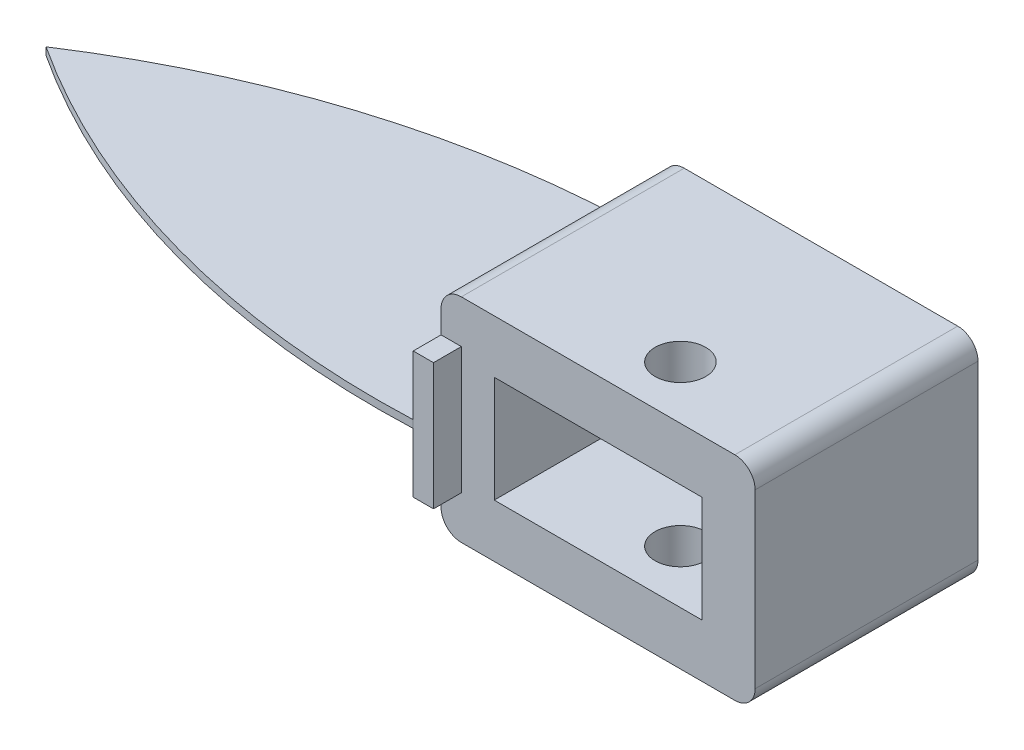
ISO-10303-21;
HEADER;
FILE_DESCRIPTION(('STEP AP214'),'2;1');
FILE_NAME('part.step','',(''),(''),'','','');
FILE_SCHEMA(('AUTOMOTIVE_DESIGN { 1 0 10303 214 1 1 1 1 }'));
ENDSEC;
DATA;
#1=APPLICATION_CONTEXT('core data for automotive mechanical design processes');
#2=APPLICATION_PROTOCOL_DEFINITION('international standard','automotive_design',2000,#1);
#3=PRODUCT_CONTEXT('',#1,'mechanical');
#4=PRODUCT('Part','Part','',(#3));
#5=PRODUCT_RELATED_PRODUCT_CATEGORY('part','',(#4));
#6=PRODUCT_DEFINITION_FORMATION('','',#4);
#7=PRODUCT_DEFINITION_CONTEXT('part definition',#1,'design');
#8=PRODUCT_DEFINITION('design','',#6,#7);
#9=PRODUCT_DEFINITION_SHAPE('','',#8);
#10=(LENGTH_UNIT() NAMED_UNIT(*) SI_UNIT(.MILLI.,.METRE.));
#11=(NAMED_UNIT(*) PLANE_ANGLE_UNIT() SI_UNIT($,.RADIAN.));
#12=(NAMED_UNIT(*) SI_UNIT($,.STERADIAN.) SOLID_ANGLE_UNIT());
#13=UNCERTAINTY_MEASURE_WITH_UNIT(LENGTH_MEASURE(1.E-05),#10,'distance_accuracy_value','');
#14=(GEOMETRIC_REPRESENTATION_CONTEXT(3) GLOBAL_UNCERTAINTY_ASSIGNED_CONTEXT((#13)) GLOBAL_UNIT_ASSIGNED_CONTEXT((#10,
#11,#12)) REPRESENTATION_CONTEXT('',''));
#15=CARTESIAN_POINT('',(0.,0.,0.));
#16=DIRECTION('',(0.,0.,1.));
#17=DIRECTION('',(1.,0.,0.));
#18=AXIS2_PLACEMENT_3D('',#15,#16,#17);
#19=CARTESIAN_POINT('',(-29.0958378036936,16.8639271046167,43.));
#20=DIRECTION('',(1.,0.,0.));
#21=DIRECTION('',(0.,1.,0.));
#22=AXIS2_PLACEMENT_3D('',#19,#20,#21);
#23=PLANE('',#22);
#24=DIRECTION('',(0.,0.,1.));
#25=VECTOR('',#24,1.);
#26=CARTESIAN_POINT('',(-29.0958378036936,-4.88607289538325,0.));
#27=LINE('',#26,#25);
#28=CARTESIAN_POINT('',(-29.0958378036936,-4.88607289538325,-6.50000000000001));
#29=VERTEX_POINT('',#28);
#30=CARTESIAN_POINT('',(-29.0958378036936,-4.88607289538325,48.5));
#31=VERTEX_POINT('',#30);
#32=EDGE_CURVE('E206',#29,#31,#27,.T.);
#33=ORIENTED_EDGE('',*,*,#32,.F.);
#34=DIRECTION('',(0.,-1.,0.));
#35=VECTOR('',#34,1.);
#36=CARTESIAN_POINT('',(-29.0958378036936,8.36392710461676,-6.50000000000001));
#37=LINE('',#36,#35);
#38=CARTESIAN_POINT('',(-29.0958378036936,-16.6360728953832,-6.50000000000001));
#39=VERTEX_POINT('',#38);
#40=EDGE_CURVE('E201',#29,#39,#37,.T.);
#41=ORIENTED_EDGE('',*,*,#40,.T.);
#42=DIRECTION('',(0.,0.,1.));
#43=VECTOR('',#42,1.);
#44=CARTESIAN_POINT('',(-29.0958378036936,-16.6360728953832,-6.50000000000001));
#45=LINE('',#44,#43);
#46=CARTESIAN_POINT('',(-29.0958378036936,-16.6360728953832,-1.));
#47=VERTEX_POINT('',#46);
#48=EDGE_CURVE('E235',#39,#47,#45,.T.);
#49=ORIENTED_EDGE('',*,*,#48,.T.);
#50=DIRECTION('',(0.,1.,0.));
#51=VECTOR('',#50,1.);
#52=CARTESIAN_POINT('',(-29.0958378036936,0.,-1.));
#53=LINE('',#52,#51);
#54=CARTESIAN_POINT('',(-29.0958378036936,-21.1360728953832,-1.));
#55=VERTEX_POINT('',#54);
#56=EDGE_CURVE('E252',#55,#47,#53,.T.);
#57=ORIENTED_EDGE('',*,*,#56,.F.);
#58=DIRECTION('',(0.,0.,1.));
#59=VECTOR('',#58,1.);
#60=CARTESIAN_POINT('',(-29.0958378036936,-21.1360728953832,43.));
#61=LINE('',#60,#59);
#62=CARTESIAN_POINT('',(-29.0958378036936,-21.1360728953832,43.));
#63=VERTEX_POINT('',#62);
#64=EDGE_CURVE('E353',#55,#63,#61,.T.);
#65=ORIENTED_EDGE('',*,*,#64,.T.);
#66=DIRECTION('',(0.,-1.,0.));
#67=VECTOR('',#66,1.);
#68=CARTESIAN_POINT('',(-29.0958378036936,16.8639271046167,43.));
#69=LINE('',#68,#67);
#70=CARTESIAN_POINT('',(-29.0958378036936,-16.6360728953832,43.));
#71=VERTEX_POINT('',#70);
#72=EDGE_CURVE('E330',#71,#63,#69,.T.);
#73=ORIENTED_EDGE('',*,*,#72,.F.);
#74=DIRECTION('',(0.,0.,-1.));
#75=VECTOR('',#74,1.);
#76=CARTESIAN_POINT('',(-29.0958378036936,-16.6360728953832,48.5));
#77=LINE('',#76,#75);
#78=CARTESIAN_POINT('',(-29.0958378036936,-16.6360728953832,48.5));
#79=VERTEX_POINT('',#78);
#80=EDGE_CURVE('E306',#79,#71,#77,.T.);
#81=ORIENTED_EDGE('',*,*,#80,.F.);
#82=DIRECTION('',(0.,-1.,0.));
#83=VECTOR('',#82,1.);
#84=CARTESIAN_POINT('',(-29.0958378036936,8.36392710461676,48.5));
#85=LINE('',#84,#83);
#86=EDGE_CURVE('E214',#31,#79,#85,.T.);
#87=ORIENTED_EDGE('',*,*,#86,.F.);
#88=EDGE_LOOP('',(#33,#41,#49,#57,#65,#73,#81,#87));
#89=FACE_BOUND('',#88,.T.);
#90=ADVANCED_FACE('F35',(#89),#23,.F.);
#91=CARTESIAN_POINT('',(-25.0958378036936,12.8639271046167,43.));
#92=DIRECTION('',(0.,0.,-1.));
#93=DIRECTION('',(-1.,0.,0.));
#94=AXIS2_PLACEMENT_3D('',#91,#92,#93);
#95=CYLINDRICAL_SURFACE('',#94,4.);
#96=DIRECTION('',(0.,0.,-1.));
#97=VECTOR('',#96,1.);
#98=CARTESIAN_POINT('',(-29.0958378036936,12.8639271046167,43.));
#99=LINE('',#98,#97);
#100=CARTESIAN_POINT('',(-29.0958378036936,12.8639271046167,43.));
#101=VERTEX_POINT('',#100);
#102=CARTESIAN_POINT('',(-29.0958378036936,12.8639271046167,-1.));
#103=VERTEX_POINT('',#102);
#104=EDGE_CURVE('E373',#101,#103,#99,.T.);
#105=ORIENTED_EDGE('',*,*,#104,.F.);
#106=CARTESIAN_POINT('',(-25.0958378036936,12.8639271046167,43.));
#107=DIRECTION('',(0.,0.,1.));
#108=DIRECTION('',(1.,0.,0.));
#109=AXIS2_PLACEMENT_3D('',#106,#107,#108);
#110=CIRCLE('',#109,4.);
#111=CARTESIAN_POINT('',(-25.0958378036936,16.8639271046167,43.));
#112=VERTEX_POINT('',#111);
#113=EDGE_CURVE('E379',#112,#101,#110,.T.);
#114=ORIENTED_EDGE('',*,*,#113,.F.);
#115=DIRECTION('',(0.,0.,-1.));
#116=VECTOR('',#115,1.);
#117=CARTESIAN_POINT('',(-25.0958378036936,16.8639271046167,43.));
#118=LINE('',#117,#116);
#119=CARTESIAN_POINT('',(-25.0958378036936,16.8639271046167,-1.));
#120=VERTEX_POINT('',#119);
#121=EDGE_CURVE('E376',#120,#112,#118,.F.);
#122=ORIENTED_EDGE('',*,*,#121,.F.);
#123=CARTESIAN_POINT('',(-25.0958378036936,12.8639271046167,-1.));
#124=DIRECTION('',(0.,0.,-1.));
#125=DIRECTION('',(-1.,0.,0.));
#126=AXIS2_PLACEMENT_3D('',#123,#124,#125);
#127=CIRCLE('',#126,4.);
#128=EDGE_CURVE('E381',#103,#120,#127,.T.);
#129=ORIENTED_EDGE('',*,*,#128,.F.);
#130=EDGE_LOOP('',(#105,#114,#122,#129));
#131=FACE_BOUND('',#130,.T.);
#132=ADVANCED_FACE('F37',(#131),#95,.T.);
#133=CARTESIAN_POINT('',(28.9041621963064,12.8639271046168,43.));
#134=DIRECTION('',(0.,0.,-1.));
#135=DIRECTION('',(-1.,0.,0.));
#136=AXIS2_PLACEMENT_3D('',#133,#134,#135);
#137=CYLINDRICAL_SURFACE('',#136,4.);
#138=DIRECTION('',(0.,0.,-1.));
#139=VECTOR('',#138,1.);
#140=CARTESIAN_POINT('',(28.9041621963064,16.8639271046168,43.));
#141=LINE('',#140,#139);
#142=CARTESIAN_POINT('',(28.9041621963064,16.8639271046168,43.));
#143=VERTEX_POINT('',#142);
#144=CARTESIAN_POINT('',(28.9041621963064,16.8639271046168,-1.));
#145=VERTEX_POINT('',#144);
#146=EDGE_CURVE('E363',#143,#145,#141,.T.);
#147=ORIENTED_EDGE('',*,*,#146,.F.);
#148=CARTESIAN_POINT('',(28.9041621963064,12.8639271046168,43.));
#149=DIRECTION('',(0.,0.,1.));
#150=DIRECTION('',(1.,0.,0.));
#151=AXIS2_PLACEMENT_3D('',#148,#149,#150);
#152=CIRCLE('',#151,4.);
#153=CARTESIAN_POINT('',(32.9041621963064,12.8639271046168,43.));
#154=VERTEX_POINT('',#153);
#155=EDGE_CURVE('E369',#154,#143,#152,.T.);
#156=ORIENTED_EDGE('',*,*,#155,.F.);
#157=DIRECTION('',(0.,0.,-1.));
#158=VECTOR('',#157,1.);
#159=CARTESIAN_POINT('',(32.9041621963064,12.8639271046168,43.));
#160=LINE('',#159,#158);
#161=CARTESIAN_POINT('',(32.9041621963064,12.8639271046168,-1.));
#162=VERTEX_POINT('',#161);
#163=EDGE_CURVE('E366',#162,#154,#160,.F.);
#164=ORIENTED_EDGE('',*,*,#163,.F.);
#165=CARTESIAN_POINT('',(28.9041621963064,12.8639271046168,-1.));
#166=DIRECTION('',(0.,0.,-1.));
#167=DIRECTION('',(-1.,0.,0.));
#168=AXIS2_PLACEMENT_3D('',#165,#166,#167);
#169=CIRCLE('',#168,4.);
#170=EDGE_CURVE('E371',#145,#162,#169,.T.);
#171=ORIENTED_EDGE('',*,*,#170,.F.);
#172=EDGE_LOOP('',(#147,#156,#164,#171));
#173=FACE_BOUND('',#172,.T.);
#174=ADVANCED_FACE('F439',(#173),#137,.T.);
#175=CARTESIAN_POINT('',(-25.0958378036936,-21.1360728953832,43.));
#176=DIRECTION('',(0.,0.,1.));
#177=DIRECTION('',(1.,0.,0.));
#178=AXIS2_PLACEMENT_3D('',#175,#176,#177);
#179=CYLINDRICAL_SURFACE('',#178,4.);
#180=ORIENTED_EDGE('',*,*,#64,.F.);
#181=CARTESIAN_POINT('',(-25.0958378036936,-21.1360728953832,-1.));
#182=DIRECTION('',(0.,0.,-1.));
#183=DIRECTION('',(-1.,0.,0.));
#184=AXIS2_PLACEMENT_3D('',#181,#182,#183);
#185=CIRCLE('',#184,4.);
#186=CARTESIAN_POINT('',(-25.0958378036936,-25.1360728953832,-1.));
#187=VERTEX_POINT('',#186);
#188=EDGE_CURVE('E359',#187,#55,#185,.T.);
#189=ORIENTED_EDGE('',*,*,#188,.F.);
#190=DIRECTION('',(0.,0.,1.));
#191=VECTOR('',#190,1.);
#192=CARTESIAN_POINT('',(-25.0958378036936,-25.1360728953832,43.));
#193=LINE('',#192,#191);
#194=CARTESIAN_POINT('',(-25.0958378036936,-25.1360728953832,43.));
#195=VERTEX_POINT('',#194);
#196=EDGE_CURVE('E356',#195,#187,#193,.F.);
#197=ORIENTED_EDGE('',*,*,#196,.F.);
#198=CARTESIAN_POINT('',(-25.0958378036936,-21.1360728953832,43.));
#199=DIRECTION('',(0.,0.,1.));
#200=DIRECTION('',(1.,0.,0.));
#201=AXIS2_PLACEMENT_3D('',#198,#199,#200);
#202=CIRCLE('',#201,4.);
#203=EDGE_CURVE('E361',#63,#195,#202,.T.);
#204=ORIENTED_EDGE('',*,*,#203,.F.);
#205=EDGE_LOOP('',(#180,#189,#197,#204));
#206=FACE_BOUND('',#205,.T.);
#207=ADVANCED_FACE('F399',(#206),#179,.T.);
#208=CARTESIAN_POINT('',(28.9041621963064,-21.1360728953832,43.));
#209=DIRECTION('',(0.,0.,1.));
#210=DIRECTION('',(1.,0.,0.));
#211=AXIS2_PLACEMENT_3D('',#208,#209,#210);
#212=CYLINDRICAL_SURFACE('',#211,4.);
#213=DIRECTION('',(0.,0.,1.));
#214=VECTOR('',#213,1.);
#215=CARTESIAN_POINT('',(28.9041621963064,-25.1360728953832,43.));
#216=LINE('',#215,#214);
#217=CARTESIAN_POINT('',(28.9041621963064,-25.1360728953832,-1.));
#218=VERTEX_POINT('',#217);
#219=CARTESIAN_POINT('',(28.9041621963064,-25.1360728953832,43.));
#220=VERTEX_POINT('',#219);
#221=EDGE_CURVE('E341',#218,#220,#216,.T.);
#222=ORIENTED_EDGE('',*,*,#221,.F.);
#223=CARTESIAN_POINT('',(28.9041621963064,-21.1360728953832,-1.));
#224=DIRECTION('',(0.,0.,-1.));
#225=DIRECTION('',(-1.,0.,0.));
#226=AXIS2_PLACEMENT_3D('',#223,#224,#225);
#227=CIRCLE('',#226,4.);
#228=CARTESIAN_POINT('',(32.9041621963064,-21.1360728953832,-1.));
#229=VERTEX_POINT('',#228);
#230=EDGE_CURVE('E349',#229,#218,#227,.T.);
#231=ORIENTED_EDGE('',*,*,#230,.F.);
#232=DIRECTION('',(0.,0.,1.));
#233=VECTOR('',#232,1.);
#234=CARTESIAN_POINT('',(32.9041621963064,-21.1360728953832,43.));
#235=LINE('',#234,#233);
#236=CARTESIAN_POINT('',(32.9041621963064,-21.1360728953832,43.));
#237=VERTEX_POINT('',#236);
#238=EDGE_CURVE('E346',#237,#229,#235,.F.);
#239=ORIENTED_EDGE('',*,*,#238,.F.);
#240=CARTESIAN_POINT('',(28.9041621963064,-21.1360728953832,43.));
#241=DIRECTION('',(0.,0.,1.));
#242=DIRECTION('',(1.,0.,0.));
#243=AXIS2_PLACEMENT_3D('',#240,#241,#242);
#244=CIRCLE('',#243,4.);
#245=EDGE_CURVE('E351',#220,#237,#244,.T.);
#246=ORIENTED_EDGE('',*,*,#245,.F.);
#247=EDGE_LOOP('',(#222,#231,#239,#246));
#248=FACE_BOUND('',#247,.T.);
#249=ADVANCED_FACE('F479',(#248),#212,.T.);
#250=CARTESIAN_POINT('',(-18.5958378036936,6.36392710461675,43.));
#251=DIRECTION('',(1.,0.,0.));
#252=DIRECTION('',(0.,1.,0.));
#253=AXIS2_PLACEMENT_3D('',#250,#251,#252);
#254=PLANE('',#253);
#255=DIRECTION('',(0.,0.,-1.));
#256=VECTOR('',#255,1.);
#257=CARTESIAN_POINT('',(-18.5958378036936,-14.6360728953832,43.));
#258=LINE('',#257,#256);
#259=CARTESIAN_POINT('',(-18.5958378036936,-14.6360728953832,43.));
#260=VERTEX_POINT('',#259);
#261=CARTESIAN_POINT('',(-18.5958378036936,-14.6360728953832,1.));
#262=VERTEX_POINT('',#261);
#263=EDGE_CURVE('E327',#260,#262,#258,.T.);
#264=ORIENTED_EDGE('',*,*,#263,.T.);
#265=DIRECTION('',(0.,-1.,0.));
#266=VECTOR('',#265,1.);
#267=CARTESIAN_POINT('',(-18.5958378036936,0.,1.));
#268=LINE('',#267,#266);
#269=CARTESIAN_POINT('',(-18.5958378036936,6.36392710461675,1.));
#270=VERTEX_POINT('',#269);
#271=EDGE_CURVE('E263',#270,#262,#268,.T.);
#272=ORIENTED_EDGE('',*,*,#271,.F.);
#273=DIRECTION('',(0.,0.,-1.));
#274=VECTOR('',#273,1.);
#275=CARTESIAN_POINT('',(-18.5958378036936,6.36392710461675,43.));
#276=LINE('',#275,#274);
#277=CARTESIAN_POINT('',(-18.5958378036936,6.36392710461675,43.));
#278=VERTEX_POINT('',#277);
#279=EDGE_CURVE('E318',#278,#270,#276,.T.);
#280=ORIENTED_EDGE('',*,*,#279,.F.);
#281=DIRECTION('',(0.,-1.,0.));
#282=VECTOR('',#281,1.);
#283=CARTESIAN_POINT('',(-18.5958378036936,6.36392710461675,43.));
#284=LINE('',#283,#282);
#285=EDGE_CURVE('E309',#278,#260,#284,.T.);
#286=ORIENTED_EDGE('',*,*,#285,.T.);
#287=EDGE_LOOP('',(#264,#272,#280,#286));
#288=FACE_BOUND('',#287,.T.);
#289=ADVANCED_FACE('F461',(#288),#254,.T.);
#290=CARTESIAN_POINT('',(-18.5958378036936,-14.6360728953832,43.));
#291=DIRECTION('',(0.,1.,0.));
#292=DIRECTION('',(-1.,0.,0.));
#293=AXIS2_PLACEMENT_3D('',#290,#291,#292);
#294=PLANE('',#293);
#295=CARTESIAN_POINT('',(7.65377673171643,-14.6360728953832,32.50038546459));
#296=DIRECTION('',(0.,1.,0.));
#297=DIRECTION('',(-1.,0.,0.));
#298=AXIS2_PLACEMENT_3D('',#295,#296,#297);
#299=CIRCLE('',#298,5.);
#300=CARTESIAN_POINT('',(2.65377673171643,-14.6360728953832,32.50038546459));
#301=VERTEX_POINT('',#300);
#302=EDGE_CURVE('E276',#301,#301,#299,.T.);
#303=ORIENTED_EDGE('',*,*,#302,.F.);
#304=EDGE_LOOP('',(#303));
#305=FACE_BOUND('',#304,.T.);
#306=DIRECTION('',(0.,0.,-1.));
#307=VECTOR('',#306,1.);
#308=CARTESIAN_POINT('',(22.4041621963064,-14.6360728953832,43.));
#309=LINE('',#308,#307);
#310=CARTESIAN_POINT('',(22.4041621963064,-14.6360728953832,43.));
#311=VERTEX_POINT('',#310);
#312=CARTESIAN_POINT('',(22.4041621963064,-14.6360728953832,1.));
#313=VERTEX_POINT('',#312);
#314=EDGE_CURVE('E324',#311,#313,#309,.T.);
#315=ORIENTED_EDGE('',*,*,#314,.T.);
#316=DIRECTION('',(1.,0.,0.));
#317=VECTOR('',#316,1.);
#318=CARTESIAN_POINT('',(0.,-14.6360728953832,1.));
#319=LINE('',#318,#317);
#320=EDGE_CURVE('E261',#262,#313,#319,.T.);
#321=ORIENTED_EDGE('',*,*,#320,.F.);
#322=ORIENTED_EDGE('',*,*,#263,.F.);
#323=DIRECTION('',(1.,0.,0.));
#324=VECTOR('',#323,1.);
#325=CARTESIAN_POINT('',(-18.5958378036936,-14.6360728953832,43.));
#326=LINE('',#325,#324);
#327=EDGE_CURVE('E311',#260,#311,#326,.T.);
#328=ORIENTED_EDGE('',*,*,#327,.T.);
#329=EDGE_LOOP('',(#315,#321,#322,#328));
#330=FACE_BOUND('',#329,.T.);
#331=ADVANCED_FACE('F505',(#305,#330),#294,.T.);
#332=CARTESIAN_POINT('',(22.4041621963064,6.36392710461676,43.));
#333=DIRECTION('',(-1.,0.,0.));
#334=DIRECTION('',(0.,-1.,0.));
#335=AXIS2_PLACEMENT_3D('',#332,#333,#334);
#336=PLANE('',#335);
#337=DIRECTION('',(0.,0.,-1.));
#338=VECTOR('',#337,1.);
#339=CARTESIAN_POINT('',(22.4041621963064,6.36392710461676,43.));
#340=LINE('',#339,#338);
#341=CARTESIAN_POINT('',(22.4041621963064,6.36392710461676,43.));
#342=VERTEX_POINT('',#341);
#343=CARTESIAN_POINT('',(22.4041621963064,6.36392710461676,1.));
#344=VERTEX_POINT('',#343);
#345=EDGE_CURVE('E321',#342,#344,#340,.T.);
#346=ORIENTED_EDGE('',*,*,#345,.T.);
#347=DIRECTION('',(0.,1.,0.));
#348=VECTOR('',#347,1.);
#349=CARTESIAN_POINT('',(22.4041621963064,0.,1.));
#350=LINE('',#349,#348);
#351=EDGE_CURVE('E267',#313,#344,#350,.T.);
#352=ORIENTED_EDGE('',*,*,#351,.F.);
#353=ORIENTED_EDGE('',*,*,#314,.F.);
#354=DIRECTION('',(0.,1.,0.));
#355=VECTOR('',#354,1.);
#356=CARTESIAN_POINT('',(22.4041621963064,6.36392710461676,43.));
#357=LINE('',#356,#355);
#358=EDGE_CURVE('E313',#311,#342,#357,.T.);
#359=ORIENTED_EDGE('',*,*,#358,.T.);
#360=EDGE_LOOP('',(#346,#352,#353,#359));
#361=FACE_BOUND('',#360,.T.);
#362=ADVANCED_FACE('F456',(#361),#336,.T.);
#363=CARTESIAN_POINT('',(-18.5958378036936,6.36392710461675,43.));
#364=DIRECTION('',(0.,-1.,0.));
#365=DIRECTION('',(1.,0.,0.));
#366=AXIS2_PLACEMENT_3D('',#363,#364,#365);
#367=PLANE('',#366);
#368=CARTESIAN_POINT('',(7.65377673171643,6.36392710461675,32.50038546459));
#369=DIRECTION('',(0.,-1.,0.));
#370=DIRECTION('',(1.,0.,0.));
#371=AXIS2_PLACEMENT_3D('',#368,#369,#370);
#372=CIRCLE('',#371,5.);
#373=CARTESIAN_POINT('',(12.6537767317164,6.36392710461676,32.50038546459));
#374=VERTEX_POINT('',#373);
#375=EDGE_CURVE('E273',#374,#374,#372,.T.);
#376=ORIENTED_EDGE('',*,*,#375,.F.);
#377=EDGE_LOOP('',(#376));
#378=FACE_BOUND('',#377,.T.);
#379=ORIENTED_EDGE('',*,*,#279,.T.);
#380=DIRECTION('',(-1.,0.,0.));
#381=VECTOR('',#380,1.);
#382=CARTESIAN_POINT('',(0.,6.36392710461676,1.));
#383=LINE('',#382,#381);
#384=EDGE_CURVE('E265',#344,#270,#383,.T.);
#385=ORIENTED_EDGE('',*,*,#384,.F.);
#386=ORIENTED_EDGE('',*,*,#345,.F.);
#387=DIRECTION('',(-1.,0.,0.));
#388=VECTOR('',#387,1.);
#389=CARTESIAN_POINT('',(-18.5958378036936,6.36392710461675,43.));
#390=LINE('',#389,#388);
#391=EDGE_CURVE('E316',#342,#278,#390,.T.);
#392=ORIENTED_EDGE('',*,*,#391,.T.);
#393=EDGE_LOOP('',(#379,#385,#386,#392));
#394=FACE_BOUND('',#393,.T.);
#395=ADVANCED_FACE('F451',(#378,#394),#367,.T.);
#396=CARTESIAN_POINT('',(0.,0.,43.));
#397=DIRECTION('',(0.,0.,1.));
#398=DIRECTION('',(1.,0.,0.));
#399=AXIS2_PLACEMENT_3D('',#396,#397,#398);
#400=PLANE('',#399);
#401=DIRECTION('',(-1.,0.,0.));
#402=VECTOR('',#401,1.);
#403=CARTESIAN_POINT('',(-29.0958378036936,16.8639271046167,43.));
#404=LINE('',#403,#402);
#405=EDGE_CURVE('E338',#143,#112,#404,.T.);
#406=ORIENTED_EDGE('',*,*,#405,.T.);
#407=ORIENTED_EDGE('',*,*,#113,.T.);
#408=CARTESIAN_POINT('',(-29.0958378036936,8.36392710461676,43.));
#409=VERTEX_POINT('',#408);
#410=EDGE_CURVE('E331',#101,#409,#69,.T.);
#411=ORIENTED_EDGE('',*,*,#410,.T.);
#412=DIRECTION('',(-1.,0.,0.));
#413=VECTOR('',#412,1.);
#414=CARTESIAN_POINT('',(-29.0958378036936,8.36392710461676,43.));
#415=LINE('',#414,#413);
#416=CARTESIAN_POINT('',(-25.0958378036936,8.36392710461676,43.));
#417=VERTEX_POINT('',#416);
#418=EDGE_CURVE('E295',#417,#409,#415,.T.);
#419=ORIENTED_EDGE('',*,*,#418,.F.);
#420=DIRECTION('',(0.,1.,0.));
#421=VECTOR('',#420,1.);
#422=CARTESIAN_POINT('',(-25.0958378036936,8.36392710461676,43.));
#423=LINE('',#422,#421);
#424=CARTESIAN_POINT('',(-25.0958378036936,-16.6360728953832,43.));
#425=VERTEX_POINT('',#424);
#426=EDGE_CURVE('E292',#425,#417,#423,.T.);
#427=ORIENTED_EDGE('',*,*,#426,.F.);
#428=DIRECTION('',(1.,0.,0.));
#429=VECTOR('',#428,1.);
#430=CARTESIAN_POINT('',(-29.0958378036936,-16.6360728953832,43.));
#431=LINE('',#430,#429);
#432=EDGE_CURVE('E279',#71,#425,#431,.T.);
#433=ORIENTED_EDGE('',*,*,#432,.F.);
#434=ORIENTED_EDGE('',*,*,#72,.T.);
#435=ORIENTED_EDGE('',*,*,#203,.T.);
#436=DIRECTION('',(1.,0.,0.));
#437=VECTOR('',#436,1.);
#438=CARTESIAN_POINT('',(-29.0958378036936,-25.1360728953832,43.));
#439=LINE('',#438,#437);
#440=EDGE_CURVE('E333',#195,#220,#439,.T.);
#441=ORIENTED_EDGE('',*,*,#440,.T.);
#442=ORIENTED_EDGE('',*,*,#245,.T.);
#443=DIRECTION('',(0.,1.,0.));
#444=VECTOR('',#443,1.);
#445=CARTESIAN_POINT('',(32.9041621963064,16.8639271046168,43.));
#446=LINE('',#445,#444);
#447=EDGE_CURVE('E335',#237,#154,#446,.T.);
#448=ORIENTED_EDGE('',*,*,#447,.T.);
#449=ORIENTED_EDGE('',*,*,#155,.T.);
#450=EDGE_LOOP('',(#406,#407,#411,#419,#427,#433,#434,#435,#441,#442,#448,#449));
#451=FACE_BOUND('',#450,.T.);
#452=ORIENTED_EDGE('',*,*,#327,.F.);
#453=ORIENTED_EDGE('',*,*,#285,.F.);
#454=ORIENTED_EDGE('',*,*,#391,.F.);
#455=ORIENTED_EDGE('',*,*,#358,.F.);
#456=EDGE_LOOP('',(#452,#453,#454,#455));
#457=FACE_BOUND('',#456,.T.);
#458=ADVANCED_FACE('F402',(#451,#457),#400,.T.);
#459=CARTESIAN_POINT('',(-29.0958378036936,8.36392710461676,-6.50000000000001));
#460=VERTEX_POINT('',#459);
#461=CARTESIAN_POINT('',(-29.0958378036936,-3.38607289538325,-6.50000000000001));
#462=VERTEX_POINT('',#461);
#463=EDGE_CURVE('E200',#460,#462,#37,.T.);
#464=ORIENTED_EDGE('',*,*,#463,.T.);
#465=DIRECTION('',(0.,0.,1.));
#466=VECTOR('',#465,1.);
#467=CARTESIAN_POINT('',(-29.0958378036936,-3.38607289538326,0.));
#468=LINE('',#467,#466);
#469=CARTESIAN_POINT('',(-29.0958378036936,-3.38607289538325,48.5));
#470=VERTEX_POINT('',#469);
#471=EDGE_CURVE('E419',#462,#470,#468,.T.);
#472=ORIENTED_EDGE('',*,*,#471,.T.);
#473=CARTESIAN_POINT('',(-29.0958378036936,8.36392710461676,48.5));
#474=VERTEX_POINT('',#473);
#475=EDGE_CURVE('E280',#474,#470,#85,.T.);
#476=ORIENTED_EDGE('',*,*,#475,.F.);
#477=DIRECTION('',(0.,0.,-1.));
#478=VECTOR('',#477,1.);
#479=CARTESIAN_POINT('',(-29.0958378036936,8.36392710461676,48.5));
#480=LINE('',#479,#478);
#481=EDGE_CURVE('E289',#474,#409,#480,.T.);
#482=ORIENTED_EDGE('',*,*,#481,.T.);
#483=ORIENTED_EDGE('',*,*,#410,.F.);
#484=ORIENTED_EDGE('',*,*,#104,.T.);
#485=CARTESIAN_POINT('',(-29.0958378036936,8.36392710461676,-1.));
#486=VERTEX_POINT('',#485);
#487=EDGE_CURVE('E251',#486,#103,#53,.T.);
#488=ORIENTED_EDGE('',*,*,#487,.F.);
#489=DIRECTION('',(0.,0.,1.));
#490=VECTOR('',#489,1.);
#491=CARTESIAN_POINT('',(-29.0958378036936,8.36392710461676,-6.50000000000001));
#492=LINE('',#491,#490);
#493=EDGE_CURVE('E236',#460,#486,#492,.T.);
#494=ORIENTED_EDGE('',*,*,#493,.F.);
#495=EDGE_LOOP('',(#464,#472,#476,#482,#483,#484,#488,#494));
#496=FACE_BOUND('',#495,.T.);
#497=ADVANCED_FACE('F435',(#496),#23,.F.);
#498=CARTESIAN_POINT('',(-29.0958378036936,-25.1360728953832,43.));
#499=DIRECTION('',(0.,1.,0.));
#500=DIRECTION('',(-1.,0.,0.));
#501=AXIS2_PLACEMENT_3D('',#498,#499,#500);
#502=PLANE('',#501);
#503=CARTESIAN_POINT('',(7.65377673171643,-25.1360728953833,32.50038546459));
#504=DIRECTION('',(0.,1.,0.));
#505=DIRECTION('',(-1.,0.,0.));
#506=AXIS2_PLACEMENT_3D('',#503,#504,#505);
#507=CIRCLE('',#506,5.);
#508=CARTESIAN_POINT('',(2.65377673171643,-25.1360728953833,32.50038546459));
#509=VERTEX_POINT('',#508);
#510=EDGE_CURVE('E270',#509,#509,#507,.T.);
#511=ORIENTED_EDGE('',*,*,#510,.T.);
#512=EDGE_LOOP('',(#511));
#513=FACE_BOUND('',#512,.T.);
#514=ORIENTED_EDGE('',*,*,#440,.F.);
#515=ORIENTED_EDGE('',*,*,#196,.T.);
#516=DIRECTION('',(-1.,0.,0.));
#517=VECTOR('',#516,1.);
#518=CARTESIAN_POINT('',(0.,-25.1360728953832,-1.));
#519=LINE('',#518,#517);
#520=EDGE_CURVE('E248',#218,#187,#519,.T.);
#521=ORIENTED_EDGE('',*,*,#520,.F.);
#522=ORIENTED_EDGE('',*,*,#221,.T.);
#523=EDGE_LOOP('',(#514,#515,#521,#522));
#524=FACE_BOUND('',#523,.T.);
#525=ADVANCED_FACE('F444',(#513,#524),#502,.F.);
#526=CARTESIAN_POINT('',(32.9041621963064,16.8639271046168,43.));
#527=DIRECTION('',(-1.,0.,0.));
#528=DIRECTION('',(0.,0.,1.));
#529=AXIS2_PLACEMENT_3D('',#526,#527,#528);
#530=PLANE('',#529);
#531=DIRECTION('',(0.,-1.,0.));
#532=VECTOR('',#531,1.);
#533=CARTESIAN_POINT('',(32.9041621963064,0.,-1.));
#534=LINE('',#533,#532);
#535=EDGE_CURVE('E256',#162,#229,#534,.T.);
#536=ORIENTED_EDGE('',*,*,#535,.F.);
#537=ORIENTED_EDGE('',*,*,#163,.T.);
#538=ORIENTED_EDGE('',*,*,#447,.F.);
#539=ORIENTED_EDGE('',*,*,#238,.T.);
#540=EDGE_LOOP('',(#536,#537,#538,#539));
#541=FACE_BOUND('',#540,.T.);
#542=ADVANCED_FACE('F449',(#541),#530,.F.);
#543=CARTESIAN_POINT('',(-29.0958378036936,16.8639271046167,43.));
#544=DIRECTION('',(0.,-1.,0.));
#545=DIRECTION('',(1.,0.,0.));
#546=AXIS2_PLACEMENT_3D('',#543,#544,#545);
#547=PLANE('',#546);
#548=CARTESIAN_POINT('',(7.65377673171642,16.8639271046167,32.50038546459));
#549=DIRECTION('',(0.,1.,0.));
#550=DIRECTION('',(-1.,0.,0.));
#551=AXIS2_PLACEMENT_3D('',#548,#549,#550);
#552=CIRCLE('',#551,5.);
#553=CARTESIAN_POINT('',(2.65377673171642,16.8639271046167,32.50038546459));
#554=VERTEX_POINT('',#553);
#555=EDGE_CURVE('E269',#554,#554,#552,.T.);
#556=ORIENTED_EDGE('',*,*,#555,.F.);
#557=EDGE_LOOP('',(#556));
#558=FACE_BOUND('',#557,.T.);
#559=DIRECTION('',(1.,0.,0.));
#560=VECTOR('',#559,1.);
#561=CARTESIAN_POINT('',(0.,16.8639271046167,-1.));
#562=LINE('',#561,#560);
#563=EDGE_CURVE('E254',#120,#145,#562,.T.);
#564=ORIENTED_EDGE('',*,*,#563,.F.);
#565=ORIENTED_EDGE('',*,*,#121,.T.);
#566=ORIENTED_EDGE('',*,*,#405,.F.);
#567=ORIENTED_EDGE('',*,*,#146,.T.);
#568=EDGE_LOOP('',(#564,#565,#566,#567));
#569=FACE_BOUND('',#568,.T.);
#570=ADVANCED_FACE('F463',(#558,#569),#547,.F.);
#571=CARTESIAN_POINT('',(-29.0958378036936,-16.6360728953832,48.5));
#572=DIRECTION('',(0.,1.,0.));
#573=DIRECTION('',(0.,0.,1.));
#574=AXIS2_PLACEMENT_3D('',#571,#572,#573);
#575=PLANE('',#574);
#576=ORIENTED_EDGE('',*,*,#432,.T.);
#577=DIRECTION('',(0.,0.,-1.));
#578=VECTOR('',#577,1.);
#579=CARTESIAN_POINT('',(-25.0958378036936,-16.6360728953832,48.5));
#580=LINE('',#579,#578);
#581=CARTESIAN_POINT('',(-25.0958378036936,-16.6360728953832,48.5));
#582=VERTEX_POINT('',#581);
#583=EDGE_CURVE('E303',#582,#425,#580,.T.);
#584=ORIENTED_EDGE('',*,*,#583,.F.);
#585=DIRECTION('',(1.,0.,0.));
#586=VECTOR('',#585,1.);
#587=CARTESIAN_POINT('',(-29.0958378036936,-16.6360728953832,48.5));
#588=LINE('',#587,#586);
#589=EDGE_CURVE('E283',#79,#582,#588,.T.);
#590=ORIENTED_EDGE('',*,*,#589,.F.);
#591=ORIENTED_EDGE('',*,*,#80,.T.);
#592=EDGE_LOOP('',(#576,#584,#590,#591));
#593=FACE_BOUND('',#592,.T.);
#594=ADVANCED_FACE('F407',(#593),#575,.F.);
#595=CARTESIAN_POINT('',(-25.0958378036936,8.36392710461676,48.5));
#596=DIRECTION('',(-1.,0.,0.));
#597=DIRECTION('',(0.,0.,1.));
#598=AXIS2_PLACEMENT_3D('',#595,#596,#597);
#599=PLANE('',#598);
#600=ORIENTED_EDGE('',*,*,#426,.T.);
#601=DIRECTION('',(0.,0.,-1.));
#602=VECTOR('',#601,1.);
#603=CARTESIAN_POINT('',(-25.0958378036936,8.36392710461676,48.5));
#604=LINE('',#603,#602);
#605=CARTESIAN_POINT('',(-25.0958378036936,8.36392710461676,48.5));
#606=VERTEX_POINT('',#605);
#607=EDGE_CURVE('E300',#606,#417,#604,.T.);
#608=ORIENTED_EDGE('',*,*,#607,.F.);
#609=DIRECTION('',(0.,1.,0.));
#610=VECTOR('',#609,1.);
#611=CARTESIAN_POINT('',(-25.0958378036936,8.36392710461676,48.5));
#612=LINE('',#611,#610);
#613=EDGE_CURVE('E285',#582,#606,#612,.T.);
#614=ORIENTED_EDGE('',*,*,#613,.F.);
#615=ORIENTED_EDGE('',*,*,#583,.T.);
#616=EDGE_LOOP('',(#600,#608,#614,#615));
#617=FACE_BOUND('',#616,.T.);
#618=ADVANCED_FACE('F493',(#617),#599,.F.);
#619=CARTESIAN_POINT('',(-29.0958378036936,8.36392710461676,48.5));
#620=DIRECTION('',(0.,-1.,0.));
#621=DIRECTION('',(0.,0.,-1.));
#622=AXIS2_PLACEMENT_3D('',#619,#620,#621);
#623=PLANE('',#622);
#624=ORIENTED_EDGE('',*,*,#418,.T.);
#625=ORIENTED_EDGE('',*,*,#481,.F.);
#626=DIRECTION('',(-1.,0.,0.));
#627=VECTOR('',#626,1.);
#628=CARTESIAN_POINT('',(-29.0958378036936,8.36392710461676,48.5));
#629=LINE('',#628,#627);
#630=EDGE_CURVE('E287',#606,#474,#629,.T.);
#631=ORIENTED_EDGE('',*,*,#630,.F.);
#632=ORIENTED_EDGE('',*,*,#607,.T.);
#633=EDGE_LOOP('',(#624,#625,#631,#632));
#634=FACE_BOUND('',#633,.T.);
#635=ADVANCED_FACE('F491',(#634),#623,.F.);
#636=CARTESIAN_POINT('',(0.,0.,48.5));
#637=DIRECTION('',(0.,0.,1.));
#638=DIRECTION('',(1.,0.,0.));
#639=AXIS2_PLACEMENT_3D('',#636,#637,#638);
#640=PLANE('',#639);
#641=ORIENTED_EDGE('',*,*,#475,.T.);
#642=EDGE_CURVE('E50',#470,#31,#85,.T.);
#643=ORIENTED_EDGE('',*,*,#642,.T.);
#644=ORIENTED_EDGE('',*,*,#86,.T.);
#645=ORIENTED_EDGE('',*,*,#589,.T.);
#646=ORIENTED_EDGE('',*,*,#613,.T.);
#647=ORIENTED_EDGE('',*,*,#630,.T.);
#648=EDGE_LOOP('',(#641,#643,#644,#645,#646,#647));
#649=FACE_BOUND('',#648,.T.);
#650=ADVANCED_FACE('F411',(#649),#640,.T.);
#651=CARTESIAN_POINT('',(7.65377673171643,-25.1360728953833,32.50038546459));
#652=DIRECTION('',(0.,1.,0.));
#653=DIRECTION('',(-1.,0.,0.));
#654=AXIS2_PLACEMENT_3D('',#651,#652,#653);
#655=CYLINDRICAL_SURFACE('',#654,5.);
#656=ORIENTED_EDGE('',*,*,#375,.T.);
#657=EDGE_LOOP('',(#656));
#658=FACE_BOUND('',#657,.T.);
#659=ORIENTED_EDGE('',*,*,#555,.T.);
#660=EDGE_LOOP('',(#659));
#661=FACE_BOUND('',#660,.T.);
#662=ADVANCED_FACE('F544',(#658,#661),#655,.F.);
#663=ORIENTED_EDGE('',*,*,#302,.T.);
#664=EDGE_LOOP('',(#663));
#665=FACE_BOUND('',#664,.T.);
#666=ORIENTED_EDGE('',*,*,#510,.F.);
#667=EDGE_LOOP('',(#666));
#668=FACE_BOUND('',#667,.T.);
#669=ADVANCED_FACE('F539',(#665,#668),#655,.F.);
#670=CARTESIAN_POINT('',(12.4041621963064,-4.13607289538324,1.));
#671=DIRECTION('',(0.,0.,-1.));
#672=DIRECTION('',(-1.,0.,0.));
#673=AXIS2_PLACEMENT_3D('',#670,#671,#672);
#674=CYLINDRICAL_SURFACE('',#673,7.);
#675=CARTESIAN_POINT('',(12.4041621963064,-4.13607289538324,1.));
#676=DIRECTION('',(0.,0.,-1.));
#677=DIRECTION('',(-1.,0.,0.));
#678=AXIS2_PLACEMENT_3D('',#675,#676,#677);
#679=CIRCLE('',#678,7.);
#680=CARTESIAN_POINT('',(5.40416219630642,-4.13607289538324,1.));
#681=VERTEX_POINT('',#680);
#682=EDGE_CURVE('E258',#681,#681,#679,.T.);
#683=ORIENTED_EDGE('',*,*,#682,.F.);
#684=EDGE_LOOP('',(#683));
#685=FACE_BOUND('',#684,.T.);
#686=CARTESIAN_POINT('',(12.4041621963064,-4.13607289538324,-1.));
#687=DIRECTION('',(0.,0.,-1.));
#688=DIRECTION('',(-1.,0.,0.));
#689=AXIS2_PLACEMENT_3D('',#686,#687,#688);
#690=CIRCLE('',#689,7.);
#691=CARTESIAN_POINT('',(5.40416219630642,-4.13607289538324,-1.));
#692=VERTEX_POINT('',#691);
#693=EDGE_CURVE('E239',#692,#692,#690,.T.);
#694=ORIENTED_EDGE('',*,*,#693,.T.);
#695=EDGE_LOOP('',(#694));
#696=FACE_BOUND('',#695,.T.);
#697=ADVANCED_FACE('F530',(#685,#696),#674,.F.);
#698=CARTESIAN_POINT('',(0.,0.,1.));
#699=DIRECTION('',(0.,0.,-1.));
#700=DIRECTION('',(-1.,0.,0.));
#701=AXIS2_PLACEMENT_3D('',#698,#699,#700);
#702=PLANE('',#701);
#703=ORIENTED_EDGE('',*,*,#682,.T.);
#704=EDGE_LOOP('',(#703));
#705=FACE_BOUND('',#704,.T.);
#706=ORIENTED_EDGE('',*,*,#320,.T.);
#707=ORIENTED_EDGE('',*,*,#351,.T.);
#708=ORIENTED_EDGE('',*,*,#384,.T.);
#709=ORIENTED_EDGE('',*,*,#271,.T.);
#710=EDGE_LOOP('',(#706,#707,#708,#709));
#711=FACE_BOUND('',#710,.T.);
#712=ADVANCED_FACE('F528',(#705,#711),#702,.F.);
#713=CARTESIAN_POINT('',(0.,0.,-1.));
#714=DIRECTION('',(0.,0.,-1.));
#715=DIRECTION('',(-1.,0.,0.));
#716=AXIS2_PLACEMENT_3D('',#713,#714,#715);
#717=PLANE('',#716);
#718=DIRECTION('',(1.,0.,0.));
#719=VECTOR('',#718,1.);
#720=CARTESIAN_POINT('',(0.,8.36392710461676,-1.));
#721=LINE('',#720,#719);
#722=CARTESIAN_POINT('',(-25.0958378036936,8.36392710461676,-1.));
#723=VERTEX_POINT('',#722);
#724=EDGE_CURVE('E11',#486,#723,#721,.T.);
#725=ORIENTED_EDGE('',*,*,#724,.F.);
#726=ORIENTED_EDGE('',*,*,#487,.T.);
#727=ORIENTED_EDGE('',*,*,#128,.T.);
#728=ORIENTED_EDGE('',*,*,#563,.T.);
#729=ORIENTED_EDGE('',*,*,#170,.T.);
#730=ORIENTED_EDGE('',*,*,#535,.T.);
#731=ORIENTED_EDGE('',*,*,#230,.T.);
#732=ORIENTED_EDGE('',*,*,#520,.T.);
#733=ORIENTED_EDGE('',*,*,#188,.T.);
#734=ORIENTED_EDGE('',*,*,#56,.T.);
#735=DIRECTION('',(-1.,0.,0.));
#736=VECTOR('',#735,1.);
#737=CARTESIAN_POINT('',(0.,-16.6360728953832,-1.));
#738=LINE('',#737,#736);
#739=CARTESIAN_POINT('',(-25.0958378036936,-16.6360728953832,-1.));
#740=VERTEX_POINT('',#739);
#741=EDGE_CURVE('E383',#740,#47,#738,.T.);
#742=ORIENTED_EDGE('',*,*,#741,.F.);
#743=DIRECTION('',(0.,-1.,0.));
#744=VECTOR('',#743,1.);
#745=CARTESIAN_POINT('',(-25.0958378036936,0.,-1.));
#746=LINE('',#745,#744);
#747=EDGE_CURVE('E43',#723,#740,#746,.T.);
#748=ORIENTED_EDGE('',*,*,#747,.F.);
#749=EDGE_LOOP('',(#725,#726,#727,#728,#729,#730,#731,#732,#733,#734,#742,#748));
#750=FACE_BOUND('',#749,.T.);
#751=ORIENTED_EDGE('',*,*,#693,.F.);
#752=EDGE_LOOP('',(#751));
#753=FACE_BOUND('',#752,.T.);
#754=ADVANCED_FACE('F394',(#750,#753),#717,.T.);
#755=CARTESIAN_POINT('',(-29.0958378036936,8.36392710461676,-6.50000000000001));
#756=DIRECTION('',(0.,1.,0.));
#757=DIRECTION('',(0.,0.,1.));
#758=AXIS2_PLACEMENT_3D('',#755,#756,#757);
#759=PLANE('',#758);
#760=ORIENTED_EDGE('',*,*,#493,.T.);
#761=ORIENTED_EDGE('',*,*,#724,.T.);
#762=DIRECTION('',(0.,0.,1.));
#763=VECTOR('',#762,1.);
#764=CARTESIAN_POINT('',(-25.0958378036936,8.36392710461676,-6.50000000000001));
#765=LINE('',#764,#763);
#766=CARTESIAN_POINT('',(-25.0958378036936,8.36392710461676,-6.50000000000001));
#767=VERTEX_POINT('',#766);
#768=EDGE_CURVE('E240',#767,#723,#765,.T.);
#769=ORIENTED_EDGE('',*,*,#768,.F.);
#770=DIRECTION('',(-1.,0.,0.));
#771=VECTOR('',#770,1.);
#772=CARTESIAN_POINT('',(-29.0958378036936,8.36392710461676,-6.50000000000001));
#773=LINE('',#772,#771);
#774=EDGE_CURVE('E230',#767,#460,#773,.T.);
#775=ORIENTED_EDGE('',*,*,#774,.T.);
#776=EDGE_LOOP('',(#760,#761,#769,#775));
#777=FACE_BOUND('',#776,.T.);
#778=ADVANCED_FACE('F537',(#777),#759,.T.);
#779=CARTESIAN_POINT('',(-25.0958378036936,8.36392710461676,-6.50000000000001));
#780=DIRECTION('',(1.,0.,0.));
#781=DIRECTION('',(0.,0.,-1.));
#782=AXIS2_PLACEMENT_3D('',#779,#780,#781);
#783=PLANE('',#782);
#784=ORIENTED_EDGE('',*,*,#768,.T.);
#785=ORIENTED_EDGE('',*,*,#747,.T.);
#786=DIRECTION('',(0.,0.,1.));
#787=VECTOR('',#786,1.);
#788=CARTESIAN_POINT('',(-25.0958378036936,-16.6360728953832,-6.50000000000001));
#789=LINE('',#788,#787);
#790=CARTESIAN_POINT('',(-25.0958378036936,-16.6360728953832,-6.50000000000001));
#791=VERTEX_POINT('',#790);
#792=EDGE_CURVE('E243',#791,#740,#789,.T.);
#793=ORIENTED_EDGE('',*,*,#792,.F.);
#794=DIRECTION('',(0.,1.,0.));
#795=VECTOR('',#794,1.);
#796=CARTESIAN_POINT('',(-25.0958378036936,8.36392710461676,-6.50000000000001));
#797=LINE('',#796,#795);
#798=EDGE_CURVE('E226',#791,#767,#797,.T.);
#799=ORIENTED_EDGE('',*,*,#798,.T.);
#800=EDGE_LOOP('',(#784,#785,#793,#799));
#801=FACE_BOUND('',#800,.T.);
#802=ADVANCED_FACE('F387',(#801),#783,.T.);
#803=CARTESIAN_POINT('',(-29.0958378036936,-16.6360728953832,-6.50000000000001));
#804=DIRECTION('',(0.,-1.,0.));
#805=DIRECTION('',(0.,0.,-1.));
#806=AXIS2_PLACEMENT_3D('',#803,#804,#805);
#807=PLANE('',#806);
#808=ORIENTED_EDGE('',*,*,#792,.T.);
#809=ORIENTED_EDGE('',*,*,#741,.T.);
#810=ORIENTED_EDGE('',*,*,#48,.F.);
#811=DIRECTION('',(1.,0.,0.));
#812=VECTOR('',#811,1.);
#813=CARTESIAN_POINT('',(-29.0958378036936,-16.6360728953832,-6.50000000000001));
#814=LINE('',#813,#812);
#815=EDGE_CURVE('E220',#39,#791,#814,.T.);
#816=ORIENTED_EDGE('',*,*,#815,.T.);
#817=EDGE_LOOP('',(#808,#809,#810,#816));
#818=FACE_BOUND('',#817,.T.);
#819=ADVANCED_FACE('F389',(#818),#807,.T.);
#820=CARTESIAN_POINT('',(0.,0.,-6.50000000000001));
#821=DIRECTION('',(0.,0.,1.));
#822=DIRECTION('',(1.,0.,0.));
#823=AXIS2_PLACEMENT_3D('',#820,#821,#822);
#824=PLANE('',#823);
#825=ORIENTED_EDGE('',*,*,#463,.F.);
#826=ORIENTED_EDGE('',*,*,#774,.F.);
#827=ORIENTED_EDGE('',*,*,#798,.F.);
#828=ORIENTED_EDGE('',*,*,#815,.F.);
#829=ORIENTED_EDGE('',*,*,#40,.F.);
#830=EDGE_CURVE('E58',#462,#29,#37,.T.);
#831=ORIENTED_EDGE('',*,*,#830,.F.);
#832=EDGE_LOOP('',(#825,#826,#827,#828,#829,#831));
#833=FACE_BOUND('',#832,.T.);
#834=ADVANCED_FACE('F217',(#833),#824,.F.);
#835=CARTESIAN_POINT('',(-36.1675539094386,-3.38607289538326,163.352850524564));
#836=DIRECTION('',(0.,-1.,0.));
#837=DIRECTION('',(1.,0.,0.));
#838=AXIS2_PLACEMENT_3D('',#835,#836,#837);
#839=CYLINDRICAL_SURFACE('',#838,170.);
#840=CARTESIAN_POINT('',(-36.1675539094386,-3.38607289538326,163.352850524564));
#841=DIRECTION('',(0.,1.,0.));
#842=DIRECTION('',(-1.,0.,0.));
#843=AXIS2_PLACEMENT_3D('',#840,#841,#842);
#844=CIRCLE('',#843,170.);
#845=CARTESIAN_POINT('',(-129.095837803694,-3.38607289538327,21.));
#846=VERTEX_POINT('',#845);
#847=EDGE_CURVE('E198',#462,#846,#844,.T.);
#848=ORIENTED_EDGE('',*,*,#847,.F.);
#849=ORIENTED_EDGE('',*,*,#830,.T.);
#850=CARTESIAN_POINT('',(-36.1675539094386,-4.88607289538325,163.352850524564));
#851=DIRECTION('',(0.,1.,0.));
#852=DIRECTION('',(-1.,0.,0.));
#853=AXIS2_PLACEMENT_3D('',#850,#851,#852);
#854=CIRCLE('',#853,170.);
#855=CARTESIAN_POINT('',(-129.095837803694,-4.88607289538326,21.));
#856=VERTEX_POINT('',#855);
#857=EDGE_CURVE('E196',#29,#856,#854,.T.);
#858=ORIENTED_EDGE('',*,*,#857,.T.);
#859=DIRECTION('',(0.,-1.,0.));
#860=VECTOR('',#859,1.);
#861=CARTESIAN_POINT('',(-129.095837803694,-3.38607289538327,21.));
#862=LINE('',#861,#860);
#863=EDGE_CURVE('E221',#846,#856,#862,.T.);
#864=ORIENTED_EDGE('',*,*,#863,.F.);
#865=EDGE_LOOP('',(#848,#849,#858,#864));
#866=FACE_BOUND('',#865,.T.);
#867=ADVANCED_FACE('F194',(#866),#839,.T.);
#868=CARTESIAN_POINT('',(-36.1675539094386,-3.38607289538326,-121.352850524564));
#869=DIRECTION('',(0.,-1.,0.));
#870=DIRECTION('',(1.,0.,0.));
#871=AXIS2_PLACEMENT_3D('',#868,#869,#870);
#872=CYLINDRICAL_SURFACE('',#871,170.);
#873=ORIENTED_EDGE('',*,*,#863,.T.);
#874=CARTESIAN_POINT('',(-36.1675539094386,-4.88607289538325,-121.352850524564));
#875=DIRECTION('',(0.,1.,0.));
#876=DIRECTION('',(-1.,0.,0.));
#877=AXIS2_PLACEMENT_3D('',#874,#875,#876);
#878=CIRCLE('',#877,170.);
#879=EDGE_CURVE('E207',#856,#31,#878,.T.);
#880=ORIENTED_EDGE('',*,*,#879,.T.);
#881=ORIENTED_EDGE('',*,*,#642,.F.);
#882=CARTESIAN_POINT('',(-36.1675539094386,-3.38607289538326,-121.352850524564));
#883=DIRECTION('',(0.,1.,0.));
#884=DIRECTION('',(-1.,0.,0.));
#885=AXIS2_PLACEMENT_3D('',#882,#883,#884);
#886=CIRCLE('',#885,170.);
#887=EDGE_CURVE('E222',#846,#470,#886,.T.);
#888=ORIENTED_EDGE('',*,*,#887,.F.);
#889=EDGE_LOOP('',(#873,#880,#881,#888));
#890=FACE_BOUND('',#889,.T.);
#891=ADVANCED_FACE('F424',(#890),#872,.T.);
#892=CARTESIAN_POINT('',(0.,-3.38607289538325,0.));
#893=DIRECTION('',(0.,1.,0.));
#894=DIRECTION('',(-1.,0.,0.));
#895=AXIS2_PLACEMENT_3D('',#892,#893,#894);
#896=PLANE('',#895);
#897=ORIENTED_EDGE('',*,*,#471,.F.);
#898=ORIENTED_EDGE('',*,*,#847,.T.);
#899=ORIENTED_EDGE('',*,*,#887,.T.);
#900=EDGE_LOOP('',(#897,#898,#899));
#901=FACE_BOUND('',#900,.T.);
#902=ADVANCED_FACE('F418',(#901),#896,.T.);
#903=CARTESIAN_POINT('',(0.,-4.88607289538325,0.));
#904=DIRECTION('',(0.,1.,0.));
#905=DIRECTION('',(-1.,0.,0.));
#906=AXIS2_PLACEMENT_3D('',#903,#904,#905);
#907=PLANE('',#906);
#908=ORIENTED_EDGE('',*,*,#32,.T.);
#909=ORIENTED_EDGE('',*,*,#879,.F.);
#910=ORIENTED_EDGE('',*,*,#857,.F.);
#911=EDGE_LOOP('',(#908,#909,#910));
#912=FACE_BOUND('',#911,.T.);
#913=ADVANCED_FACE('F205',(#912),#907,.F.);
#914=CLOSED_SHELL('',(#90,#132,#174,#207,#249,#289,#331,#362,#395,#458,#497,#525,#542,#570,#594,
#618,#635,#650,#662,#669,#697,#712,#754,#778,#802,#819,#834,#867,#891,#902,#913));
#915=MANIFOLD_SOLID_BREP('B2',#914);
#916=ADVANCED_BREP_SHAPE_REPRESENTATION('',(#18,#915),#14);
#917=SHAPE_DEFINITION_REPRESENTATION(#9,#916);
ENDSEC;
END-ISO-10303-21;
